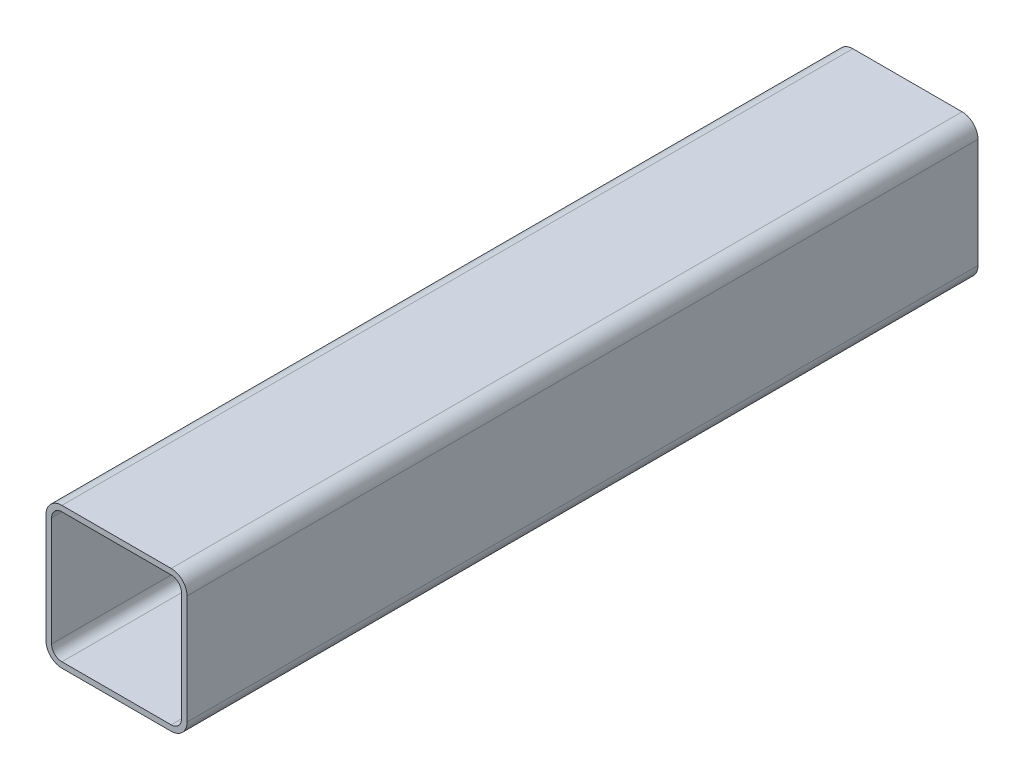
ISO-10303-21;
HEADER;
FILE_DESCRIPTION(('STEP AP214'),'2;1');
FILE_NAME('part.step','',(''),(''),'','','');
FILE_SCHEMA(('AUTOMOTIVE_DESIGN { 1 0 10303 214 1 1 1 1 }'));
ENDSEC;
DATA;
#1=APPLICATION_CONTEXT('core data for automotive mechanical design processes');
#2=APPLICATION_PROTOCOL_DEFINITION('international standard','automotive_design',2000,#1);
#3=PRODUCT_CONTEXT('',#1,'mechanical');
#4=PRODUCT('Part','Part','',(#3));
#5=PRODUCT_RELATED_PRODUCT_CATEGORY('part','',(#4));
#6=PRODUCT_DEFINITION_FORMATION('','',#4);
#7=PRODUCT_DEFINITION_CONTEXT('part definition',#1,'design');
#8=PRODUCT_DEFINITION('design','',#6,#7);
#9=PRODUCT_DEFINITION_SHAPE('','',#8);
#10=(LENGTH_UNIT() NAMED_UNIT(*) SI_UNIT(.MILLI.,.METRE.));
#11=(NAMED_UNIT(*) PLANE_ANGLE_UNIT() SI_UNIT($,.RADIAN.));
#12=(NAMED_UNIT(*) SI_UNIT($,.STERADIAN.) SOLID_ANGLE_UNIT());
#13=UNCERTAINTY_MEASURE_WITH_UNIT(LENGTH_MEASURE(1.E-05),#10,'distance_accuracy_value','');
#14=(GEOMETRIC_REPRESENTATION_CONTEXT(3) GLOBAL_UNCERTAINTY_ASSIGNED_CONTEXT((#13)) GLOBAL_UNIT_ASSIGNED_CONTEXT((#10,
#11,#12)) REPRESENTATION_CONTEXT('',''));
#15=CARTESIAN_POINT('',(0.,0.,0.));
#16=DIRECTION('',(0.,0.,1.));
#17=DIRECTION('',(1.,0.,0.));
#18=AXIS2_PLACEMENT_3D('',#15,#16,#17);
#19=CARTESIAN_POINT('',(-27.178,-27.178,-152.4));
#20=DIRECTION('',(0.,0.,1.));
#21=DIRECTION('',(1.,0.,0.));
#22=AXIS2_PLACEMENT_3D('',#19,#20,#21);
#23=PLANE('',#22);
#24=DIRECTION('',(0.,1.,0.));
#25=VECTOR('',#24,1.);
#26=CARTESIAN_POINT('',(-25.019,0.,-152.4));
#27=LINE('',#26,#25);
#28=CARTESIAN_POINT('',(-25.019,-21.0502500003569,-152.4));
#29=VERTEX_POINT('',#28);
#30=CARTESIAN_POINT('',(-25.019,21.0502499999995,-152.4));
#31=VERTEX_POINT('',#30);
#32=EDGE_CURVE('E158',#29,#31,#27,.T.);
#33=ORIENTED_EDGE('',*,*,#32,.F.);
#34=CARTESIAN_POINT('',(-21.05025,-21.0502500000011,-152.4));
#35=DIRECTION('',(0.,0.,-1.));
#36=DIRECTION('',(0.,1.,0.));
#37=AXIS2_PLACEMENT_3D('',#34,#35,#36);
#38=CIRCLE('',#37,3.96875);
#39=CARTESIAN_POINT('',(-21.0502499992366,-25.019,-152.4));
#40=VERTEX_POINT('',#39);
#41=EDGE_CURVE('E209',#40,#29,#38,.T.);
#42=ORIENTED_EDGE('',*,*,#41,.F.);
#43=DIRECTION('',(-1.,0.,0.));
#44=VECTOR('',#43,1.);
#45=CARTESIAN_POINT('',(0.,-25.019,-152.4));
#46=LINE('',#45,#44);
#47=CARTESIAN_POINT('',(21.05025,-25.019,-152.4));
#48=VERTEX_POINT('',#47);
#49=EDGE_CURVE('E154',#48,#40,#46,.T.);
#50=ORIENTED_EDGE('',*,*,#49,.F.);
#51=CARTESIAN_POINT('',(21.05025,-21.0502500000011,-152.4));
#52=DIRECTION('',(0.,0.,-1.));
#53=DIRECTION('',(0.,1.,0.));
#54=AXIS2_PLACEMENT_3D('',#51,#52,#53);
#55=CIRCLE('',#54,3.96875);
#56=CARTESIAN_POINT('',(25.019,-21.0502500008145,-152.4));
#57=VERTEX_POINT('',#56);
#58=EDGE_CURVE('E213',#57,#48,#55,.T.);
#59=ORIENTED_EDGE('',*,*,#58,.F.);
#60=DIRECTION('',(0.,-1.,0.));
#61=VECTOR('',#60,1.);
#62=CARTESIAN_POINT('',(25.019,0.,-152.4));
#63=LINE('',#62,#61);
#64=CARTESIAN_POINT('',(25.019,21.0502499999995,-152.4));
#65=VERTEX_POINT('',#64);
#66=EDGE_CURVE('E163',#65,#57,#63,.T.);
#67=ORIENTED_EDGE('',*,*,#66,.F.);
#68=CARTESIAN_POINT('',(21.05025,21.0502499999989,-152.4));
#69=DIRECTION('',(0.,0.,-1.));
#70=DIRECTION('',(0.,1.,0.));
#71=AXIS2_PLACEMENT_3D('',#68,#69,#70);
#72=CIRCLE('',#71,3.96875);
#73=CARTESIAN_POINT('',(21.050250000407,25.019,-152.4));
#74=VERTEX_POINT('',#73);
#75=EDGE_CURVE('E216',#74,#65,#72,.T.);
#76=ORIENTED_EDGE('',*,*,#75,.F.);
#77=DIRECTION('',(1.,0.,0.));
#78=VECTOR('',#77,1.);
#79=CARTESIAN_POINT('',(0.,25.019,-152.4));
#80=LINE('',#79,#78);
#81=CARTESIAN_POINT('',(-21.05025,25.019,-152.4));
#82=VERTEX_POINT('',#81);
#83=EDGE_CURVE('E168',#82,#74,#80,.T.);
#84=ORIENTED_EDGE('',*,*,#83,.F.);
#85=CARTESIAN_POINT('',(-21.05025,21.0502499999989,-152.4));
#86=DIRECTION('',(0.,0.,-1.));
#87=DIRECTION('',(0.,1.,0.));
#88=AXIS2_PLACEMENT_3D('',#85,#86,#87);
#89=CIRCLE('',#88,3.96875);
#90=EDGE_CURVE('E161',#31,#82,#89,.T.);
#91=ORIENTED_EDGE('',*,*,#90,.F.);
#92=EDGE_LOOP('',(#33,#42,#50,#59,#67,#76,#84,#91));
#93=FACE_BOUND('',#92,.T.);
#94=DIRECTION('',(0.,-1.,0.));
#95=VECTOR('',#94,1.);
#96=CARTESIAN_POINT('',(27.178,0.,-152.4));
#97=LINE('',#96,#95);
#98=CARTESIAN_POINT('',(27.178,21.0502499999997,-152.4));
#99=VERTEX_POINT('',#98);
#100=CARTESIAN_POINT('',(27.178,-21.0502500000003,-152.4));
#101=VERTEX_POINT('',#100);
#102=EDGE_CURVE('E162',#99,#101,#97,.T.);
#103=ORIENTED_EDGE('',*,*,#102,.T.);
#104=CARTESIAN_POINT('',(21.05025,-21.0502500000007,-152.4));
#105=DIRECTION('',(0.,0.,-1.));
#106=DIRECTION('',(0.,1.,0.));
#107=AXIS2_PLACEMENT_3D('',#104,#105,#106);
#108=CIRCLE('',#107,6.12775);
#109=CARTESIAN_POINT('',(21.0502500011786,-27.178,-152.4));
#110=VERTEX_POINT('',#109);
#111=EDGE_CURVE('E221',#101,#110,#108,.T.);
#112=ORIENTED_EDGE('',*,*,#111,.T.);
#113=DIRECTION('',(-1.,0.,0.));
#114=VECTOR('',#113,1.);
#115=CARTESIAN_POINT('',(0.,-27.178,-152.4));
#116=LINE('',#115,#114);
#117=CARTESIAN_POINT('',(-21.05025,-27.178,-152.4));
#118=VERTEX_POINT('',#117);
#119=EDGE_CURVE('E174',#110,#118,#116,.T.);
#120=ORIENTED_EDGE('',*,*,#119,.T.);
#121=CARTESIAN_POINT('',(-21.05025,-21.0502500000007,-152.4));
#122=DIRECTION('',(0.,0.,-1.));
#123=DIRECTION('',(0.,1.,0.));
#124=AXIS2_PLACEMENT_3D('',#121,#122,#123);
#125=CIRCLE('',#124,6.12775);
#126=CARTESIAN_POINT('',(-27.178,-21.0502500005506,-152.4));
#127=VERTEX_POINT('',#126);
#128=EDGE_CURVE('E225',#118,#127,#125,.T.);
#129=ORIENTED_EDGE('',*,*,#128,.T.);
#130=DIRECTION('',(0.,1.,0.));
#131=VECTOR('',#130,1.);
#132=CARTESIAN_POINT('',(-27.178,0.,-152.4));
#133=LINE('',#132,#131);
#134=CARTESIAN_POINT('',(-27.178,21.0502499999997,-152.4));
#135=VERTEX_POINT('',#134);
#136=EDGE_CURVE('E179',#127,#135,#133,.T.);
#137=ORIENTED_EDGE('',*,*,#136,.T.);
#138=CARTESIAN_POINT('',(-21.05025,21.0502499999993,-152.4));
#139=DIRECTION('',(0.,0.,-1.));
#140=DIRECTION('',(0.,1.,0.));
#141=AXIS2_PLACEMENT_3D('',#138,#139,#140);
#142=CIRCLE('',#141,6.12775);
#143=CARTESIAN_POINT('',(-21.0502499993716,27.178,-152.4));
#144=VERTEX_POINT('',#143);
#145=EDGE_CURVE('E141',#135,#144,#142,.T.);
#146=ORIENTED_EDGE('',*,*,#145,.T.);
#147=DIRECTION('',(1.,0.,0.));
#148=VECTOR('',#147,1.);
#149=CARTESIAN_POINT('',(0.,27.178,-152.4));
#150=LINE('',#149,#148);
#151=CARTESIAN_POINT('',(21.05025,27.178,-152.4));
#152=VERTEX_POINT('',#151);
#153=EDGE_CURVE('E139',#144,#152,#150,.T.);
#154=ORIENTED_EDGE('',*,*,#153,.T.);
#155=CARTESIAN_POINT('',(21.05025,21.0502499999993,-152.4));
#156=DIRECTION('',(0.,0.,-1.));
#157=DIRECTION('',(0.,1.,0.));
#158=AXIS2_PLACEMENT_3D('',#155,#156,#157);
#159=CIRCLE('',#158,6.12775);
#160=EDGE_CURVE('E20',#152,#99,#159,.T.);
#161=ORIENTED_EDGE('',*,*,#160,.T.);
#162=EDGE_LOOP('',(#103,#112,#120,#129,#137,#146,#154,#161));
#163=FACE_BOUND('',#162,.T.);
#164=ADVANCED_FACE('F16',(#93,#163),#23,.F.);
#165=CARTESIAN_POINT('',(21.05025,21.05025,152.4));
#166=DIRECTION('',(0.,0.,-1.));
#167=DIRECTION('',(0.,1.,0.));
#168=AXIS2_PLACEMENT_3D('',#165,#166,#167);
#169=CYLINDRICAL_SURFACE('',#168,6.12775);
#170=DIRECTION('',(0.,0.,1.));
#171=VECTOR('',#170,1.);
#172=CARTESIAN_POINT('',(21.05025,27.178,0.));
#173=LINE('',#172,#171);
#174=CARTESIAN_POINT('',(21.05025,27.178,152.4));
#175=VERTEX_POINT('',#174);
#176=EDGE_CURVE('E131',#152,#175,#173,.T.);
#177=ORIENTED_EDGE('',*,*,#176,.T.);
#178=CARTESIAN_POINT('',(21.05025,21.05025,152.4));
#179=DIRECTION('',(0.,0.,-1.));
#180=DIRECTION('',(0.,1.,0.));
#181=AXIS2_PLACEMENT_3D('',#178,#179,#180);
#182=CIRCLE('',#181,6.12775);
#183=CARTESIAN_POINT('',(27.178,21.05025,152.4));
#184=VERTEX_POINT('',#183);
#185=EDGE_CURVE('E207',#184,#175,#182,.F.);
#186=ORIENTED_EDGE('',*,*,#185,.F.);
#187=DIRECTION('',(0.,0.,-1.));
#188=VECTOR('',#187,1.);
#189=CARTESIAN_POINT('',(27.178,21.05025,0.));
#190=LINE('',#189,#188);
#191=EDGE_CURVE('E134',#184,#99,#190,.T.);
#192=ORIENTED_EDGE('',*,*,#191,.T.);
#193=ORIENTED_EDGE('',*,*,#160,.F.);
#194=EDGE_LOOP('',(#177,#186,#192,#193));
#195=FACE_BOUND('',#194,.T.);
#196=ADVANCED_FACE('F129',(#195),#169,.T.);
#197=CARTESIAN_POINT('',(-21.05025,27.178,152.4));
#198=DIRECTION('',(0.,-1.,0.));
#199=DIRECTION('',(0.,0.,-1.));
#200=AXIS2_PLACEMENT_3D('',#197,#198,#199);
#201=PLANE('',#200);
#202=DIRECTION('',(0.,0.,-1.));
#203=VECTOR('',#202,1.);
#204=CARTESIAN_POINT('',(-21.0502499987432,27.178,0.));
#205=LINE('',#204,#203);
#206=CARTESIAN_POINT('',(-21.0502499993716,27.178,152.4));
#207=VERTEX_POINT('',#206);
#208=EDGE_CURVE('E144',#144,#207,#205,.F.);
#209=ORIENTED_EDGE('',*,*,#208,.T.);
#210=DIRECTION('',(-1.,0.,0.));
#211=VECTOR('',#210,1.);
#212=CARTESIAN_POINT('',(0.,27.178,152.4));
#213=LINE('',#212,#211);
#214=EDGE_CURVE('E148',#175,#207,#213,.T.);
#215=ORIENTED_EDGE('',*,*,#214,.F.);
#216=ORIENTED_EDGE('',*,*,#176,.F.);
#217=ORIENTED_EDGE('',*,*,#153,.F.);
#218=EDGE_LOOP('',(#209,#215,#216,#217));
#219=FACE_BOUND('',#218,.T.);
#220=ADVANCED_FACE('F146',(#219),#201,.F.);
#221=CARTESIAN_POINT('',(-21.05025,21.05025,152.4));
#222=DIRECTION('',(0.,0.,-1.));
#223=DIRECTION('',(0.,1.,0.));
#224=AXIS2_PLACEMENT_3D('',#221,#222,#223);
#225=CYLINDRICAL_SURFACE('',#224,6.12775);
#226=DIRECTION('',(0.,0.,1.));
#227=VECTOR('',#226,1.);
#228=CARTESIAN_POINT('',(-27.178,21.05025,0.));
#229=LINE('',#228,#227);
#230=CARTESIAN_POINT('',(-27.178,21.05025,152.4));
#231=VERTEX_POINT('',#230);
#232=EDGE_CURVE('E181',#135,#231,#229,.T.);
#233=ORIENTED_EDGE('',*,*,#232,.T.);
#234=CARTESIAN_POINT('',(-21.05025,21.05025,152.4));
#235=DIRECTION('',(0.,0.,-1.));
#236=DIRECTION('',(0.,1.,0.));
#237=AXIS2_PLACEMENT_3D('',#234,#235,#236);
#238=CIRCLE('',#237,6.12775);
#239=EDGE_CURVE('E204',#207,#231,#238,.F.);
#240=ORIENTED_EDGE('',*,*,#239,.F.);
#241=ORIENTED_EDGE('',*,*,#208,.F.);
#242=ORIENTED_EDGE('',*,*,#145,.F.);
#243=EDGE_LOOP('',(#233,#240,#241,#242));
#244=FACE_BOUND('',#243,.T.);
#245=ADVANCED_FACE('F229',(#244),#225,.T.);
#246=CARTESIAN_POINT('',(-27.178,-21.05025,152.4));
#247=DIRECTION('',(1.,0.,0.));
#248=DIRECTION('',(0.,0.,-1.));
#249=AXIS2_PLACEMENT_3D('',#246,#247,#248);
#250=PLANE('',#249);
#251=DIRECTION('',(0.,0.,-1.));
#252=VECTOR('',#251,1.);
#253=CARTESIAN_POINT('',(-27.178,-21.0502500011005,0.));
#254=LINE('',#253,#252);
#255=CARTESIAN_POINT('',(-27.178,-21.0502500005502,152.4));
#256=VERTEX_POINT('',#255);
#257=EDGE_CURVE('E180',#127,#256,#254,.F.);
#258=ORIENTED_EDGE('',*,*,#257,.T.);
#259=DIRECTION('',(0.,-1.,0.));
#260=VECTOR('',#259,1.);
#261=CARTESIAN_POINT('',(-27.178,0.,152.4));
#262=LINE('',#261,#260);
#263=EDGE_CURVE('E203',#231,#256,#262,.T.);
#264=ORIENTED_EDGE('',*,*,#263,.F.);
#265=ORIENTED_EDGE('',*,*,#232,.F.);
#266=ORIENTED_EDGE('',*,*,#136,.F.);
#267=EDGE_LOOP('',(#258,#264,#265,#266));
#268=FACE_BOUND('',#267,.T.);
#269=ADVANCED_FACE('F261',(#268),#250,.F.);
#270=CARTESIAN_POINT('',(-21.05025,-21.05025,152.4));
#271=DIRECTION('',(0.,0.,-1.));
#272=DIRECTION('',(0.,1.,0.));
#273=AXIS2_PLACEMENT_3D('',#270,#271,#272);
#274=CYLINDRICAL_SURFACE('',#273,6.12775);
#275=DIRECTION('',(0.,0.,1.));
#276=VECTOR('',#275,1.);
#277=CARTESIAN_POINT('',(-21.05025,-27.178,0.));
#278=LINE('',#277,#276);
#279=CARTESIAN_POINT('',(-21.05025,-27.178,152.4));
#280=VERTEX_POINT('',#279);
#281=EDGE_CURVE('E178',#118,#280,#278,.T.);
#282=ORIENTED_EDGE('',*,*,#281,.T.);
#283=CARTESIAN_POINT('',(-21.05025,-21.05025,152.4));
#284=DIRECTION('',(0.,0.,-1.));
#285=DIRECTION('',(0.,1.,0.));
#286=AXIS2_PLACEMENT_3D('',#283,#284,#285);
#287=CIRCLE('',#286,6.12775);
#288=EDGE_CURVE('E200',#256,#280,#287,.F.);
#289=ORIENTED_EDGE('',*,*,#288,.F.);
#290=ORIENTED_EDGE('',*,*,#257,.F.);
#291=ORIENTED_EDGE('',*,*,#128,.F.);
#292=EDGE_LOOP('',(#282,#289,#290,#291));
#293=FACE_BOUND('',#292,.T.);
#294=ADVANCED_FACE('F263',(#293),#274,.T.);
#295=CARTESIAN_POINT('',(-21.05025,-27.178,-152.4));
#296=DIRECTION('',(0.,1.,0.));
#297=DIRECTION('',(0.,0.,1.));
#298=AXIS2_PLACEMENT_3D('',#295,#296,#297);
#299=PLANE('',#298);
#300=DIRECTION('',(0.,0.,-1.));
#301=VECTOR('',#300,1.);
#302=CARTESIAN_POINT('',(21.0502500023573,-27.178,0.));
#303=LINE('',#302,#301);
#304=CARTESIAN_POINT('',(21.0502500011786,-27.178,152.4));
#305=VERTEX_POINT('',#304);
#306=EDGE_CURVE('E177',#110,#305,#303,.F.);
#307=ORIENTED_EDGE('',*,*,#306,.T.);
#308=DIRECTION('',(1.,0.,0.));
#309=VECTOR('',#308,1.);
#310=CARTESIAN_POINT('',(0.,-27.178,152.4));
#311=LINE('',#310,#309);
#312=EDGE_CURVE('E199',#280,#305,#311,.T.);
#313=ORIENTED_EDGE('',*,*,#312,.F.);
#314=ORIENTED_EDGE('',*,*,#281,.F.);
#315=ORIENTED_EDGE('',*,*,#119,.F.);
#316=EDGE_LOOP('',(#307,#313,#314,#315));
#317=FACE_BOUND('',#316,.T.);
#318=ADVANCED_FACE('F319',(#317),#299,.F.);
#319=CARTESIAN_POINT('',(21.05025,-21.05025,152.4));
#320=DIRECTION('',(0.,0.,-1.));
#321=DIRECTION('',(0.,1.,0.));
#322=AXIS2_PLACEMENT_3D('',#319,#320,#321);
#323=CYLINDRICAL_SURFACE('',#322,6.12775);
#324=DIRECTION('',(0.,0.,1.));
#325=VECTOR('',#324,1.);
#326=CARTESIAN_POINT('',(27.178,-21.05025,0.));
#327=LINE('',#326,#325);
#328=CARTESIAN_POINT('',(27.178,-21.05025,152.4));
#329=VERTEX_POINT('',#328);
#330=EDGE_CURVE('E224',#101,#329,#327,.T.);
#331=ORIENTED_EDGE('',*,*,#330,.T.);
#332=CARTESIAN_POINT('',(21.05025,-21.05025,152.4));
#333=DIRECTION('',(0.,0.,-1.));
#334=DIRECTION('',(0.,1.,0.));
#335=AXIS2_PLACEMENT_3D('',#332,#333,#334);
#336=CIRCLE('',#335,6.12775);
#337=EDGE_CURVE('E195',#305,#329,#336,.F.);
#338=ORIENTED_EDGE('',*,*,#337,.F.);
#339=ORIENTED_EDGE('',*,*,#306,.F.);
#340=ORIENTED_EDGE('',*,*,#111,.F.);
#341=EDGE_LOOP('',(#331,#338,#339,#340));
#342=FACE_BOUND('',#341,.T.);
#343=ADVANCED_FACE('F315',(#342),#323,.T.);
#344=CARTESIAN_POINT('',(27.178,-21.05025,-152.4));
#345=DIRECTION('',(-1.,0.,0.));
#346=DIRECTION('',(0.,0.,1.));
#347=AXIS2_PLACEMENT_3D('',#344,#345,#346);
#348=PLANE('',#347);
#349=ORIENTED_EDGE('',*,*,#191,.F.);
#350=DIRECTION('',(0.,1.,0.));
#351=VECTOR('',#350,1.);
#352=CARTESIAN_POINT('',(27.178,0.,152.4));
#353=LINE('',#352,#351);
#354=EDGE_CURVE('E198',#329,#184,#353,.T.);
#355=ORIENTED_EDGE('',*,*,#354,.F.);
#356=ORIENTED_EDGE('',*,*,#330,.F.);
#357=ORIENTED_EDGE('',*,*,#102,.F.);
#358=EDGE_LOOP('',(#349,#355,#356,#357));
#359=FACE_BOUND('',#358,.T.);
#360=ADVANCED_FACE('F318',(#359),#348,.F.);
#361=CARTESIAN_POINT('',(-25.019,-21.05025,152.4));
#362=DIRECTION('',(1.,0.,0.));
#363=DIRECTION('',(0.,0.,-1.));
#364=AXIS2_PLACEMENT_3D('',#361,#362,#363);
#365=PLANE('',#364);
#366=DIRECTION('',(0.,1.,0.));
#367=VECTOR('',#366,1.);
#368=CARTESIAN_POINT('',(-25.019000009144,0.,152.4));
#369=LINE('',#368,#367);
#370=CARTESIAN_POINT('',(-25.019000004572,-21.0502500003564,152.4));
#371=VERTEX_POINT('',#370);
#372=CARTESIAN_POINT('',(-25.019000004572,21.05025,152.4));
#373=VERTEX_POINT('',#372);
#374=EDGE_CURVE('E194',#371,#373,#369,.T.);
#375=ORIENTED_EDGE('',*,*,#374,.F.);
#376=DIRECTION('',(0.,0.,-1.));
#377=VECTOR('',#376,1.);
#378=CARTESIAN_POINT('',(-25.019,-21.0502500007127,0.));
#379=LINE('',#378,#377);
#380=EDGE_CURVE('E212',#29,#371,#379,.F.);
#381=ORIENTED_EDGE('',*,*,#380,.F.);
#382=ORIENTED_EDGE('',*,*,#32,.T.);
#383=DIRECTION('',(0.,0.,1.));
#384=VECTOR('',#383,1.);
#385=CARTESIAN_POINT('',(-25.019,21.05025,0.));
#386=LINE('',#385,#384);
#387=EDGE_CURVE('E172',#373,#31,#386,.F.);
#388=ORIENTED_EDGE('',*,*,#387,.F.);
#389=EDGE_LOOP('',(#375,#381,#382,#388));
#390=FACE_BOUND('',#389,.T.);
#391=ADVANCED_FACE('F298',(#390),#365,.T.);
#392=CARTESIAN_POINT('',(-21.05025,21.05025,152.4));
#393=DIRECTION('',(0.,0.,-1.));
#394=DIRECTION('',(0.,1.,0.));
#395=AXIS2_PLACEMENT_3D('',#392,#393,#394);
#396=CYLINDRICAL_SURFACE('',#395,3.96875);
#397=CARTESIAN_POINT('',(-21.05025,21.05025,152.4));
#398=DIRECTION('',(0.,0.,-1.));
#399=DIRECTION('',(0.,1.,0.));
#400=AXIS2_PLACEMENT_3D('',#397,#398,#399);
#401=CIRCLE('',#400,3.96875);
#402=CARTESIAN_POINT('',(-21.05025,25.019000004572,152.4));
#403=VERTEX_POINT('',#402);
#404=EDGE_CURVE('E191',#373,#403,#401,.T.);
#405=ORIENTED_EDGE('',*,*,#404,.F.);
#406=ORIENTED_EDGE('',*,*,#387,.T.);
#407=ORIENTED_EDGE('',*,*,#90,.T.);
#408=DIRECTION('',(0.,0.,-1.));
#409=VECTOR('',#408,1.);
#410=CARTESIAN_POINT('',(-21.05025,25.019,0.));
#411=LINE('',#410,#409);
#412=EDGE_CURVE('E171',#403,#82,#411,.T.);
#413=ORIENTED_EDGE('',*,*,#412,.F.);
#414=EDGE_LOOP('',(#405,#406,#407,#413));
#415=FACE_BOUND('',#414,.T.);
#416=ADVANCED_FACE('F295',(#415),#396,.F.);
#417=CARTESIAN_POINT('',(-21.05025,25.019,152.4));
#418=DIRECTION('',(0.,-1.,0.));
#419=DIRECTION('',(0.,0.,-1.));
#420=AXIS2_PLACEMENT_3D('',#417,#418,#419);
#421=PLANE('',#420);
#422=DIRECTION('',(1.,0.,0.));
#423=VECTOR('',#422,1.);
#424=CARTESIAN_POINT('',(0.,25.019000009144,152.4));
#425=LINE('',#424,#423);
#426=CARTESIAN_POINT('',(21.050250000407,25.019000004572,152.4));
#427=VERTEX_POINT('',#426);
#428=EDGE_CURVE('E190',#403,#427,#425,.T.);
#429=ORIENTED_EDGE('',*,*,#428,.F.);
#430=ORIENTED_EDGE('',*,*,#412,.T.);
#431=ORIENTED_EDGE('',*,*,#83,.T.);
#432=DIRECTION('',(0.,0.,1.));
#433=VECTOR('',#432,1.);
#434=CARTESIAN_POINT('',(21.050250000814,25.019,0.));
#435=LINE('',#434,#433);
#436=EDGE_CURVE('E167',#427,#74,#435,.F.);
#437=ORIENTED_EDGE('',*,*,#436,.F.);
#438=EDGE_LOOP('',(#429,#430,#431,#437));
#439=FACE_BOUND('',#438,.T.);
#440=ADVANCED_FACE('F292',(#439),#421,.T.);
#441=CARTESIAN_POINT('',(21.05025,21.05025,152.4));
#442=DIRECTION('',(0.,0.,-1.));
#443=DIRECTION('',(0.,1.,0.));
#444=AXIS2_PLACEMENT_3D('',#441,#442,#443);
#445=CYLINDRICAL_SURFACE('',#444,3.96875);
#446=CARTESIAN_POINT('',(21.05025,21.05025,152.4));
#447=DIRECTION('',(0.,0.,-1.));
#448=DIRECTION('',(0.,1.,0.));
#449=AXIS2_PLACEMENT_3D('',#446,#447,#448);
#450=CIRCLE('',#449,3.96875);
#451=CARTESIAN_POINT('',(25.019000004572,21.05025,152.4));
#452=VERTEX_POINT('',#451);
#453=EDGE_CURVE('E187',#427,#452,#450,.T.);
#454=ORIENTED_EDGE('',*,*,#453,.F.);
#455=ORIENTED_EDGE('',*,*,#436,.T.);
#456=ORIENTED_EDGE('',*,*,#75,.T.);
#457=DIRECTION('',(0.,0.,-1.));
#458=VECTOR('',#457,1.);
#459=CARTESIAN_POINT('',(25.019,21.05025,0.));
#460=LINE('',#459,#458);
#461=EDGE_CURVE('E166',#452,#65,#460,.T.);
#462=ORIENTED_EDGE('',*,*,#461,.F.);
#463=EDGE_LOOP('',(#454,#455,#456,#462));
#464=FACE_BOUND('',#463,.T.);
#465=ADVANCED_FACE('F289',(#464),#445,.F.);
#466=CARTESIAN_POINT('',(25.019,-21.05025,-152.4));
#467=DIRECTION('',(-1.,0.,0.));
#468=DIRECTION('',(0.,0.,1.));
#469=AXIS2_PLACEMENT_3D('',#466,#467,#468);
#470=PLANE('',#469);
#471=DIRECTION('',(0.,-1.,0.));
#472=VECTOR('',#471,1.);
#473=CARTESIAN_POINT('',(25.019000009144,0.,152.4));
#474=LINE('',#473,#472);
#475=CARTESIAN_POINT('',(25.019000004572,-21.050250000814,152.4));
#476=VERTEX_POINT('',#475);
#477=EDGE_CURVE('E186',#452,#476,#474,.T.);
#478=ORIENTED_EDGE('',*,*,#477,.F.);
#479=ORIENTED_EDGE('',*,*,#461,.T.);
#480=ORIENTED_EDGE('',*,*,#66,.T.);
#481=DIRECTION('',(0.,0.,1.));
#482=VECTOR('',#481,1.);
#483=CARTESIAN_POINT('',(25.019,-21.050250001628,0.));
#484=LINE('',#483,#482);
#485=EDGE_CURVE('E157',#476,#57,#484,.F.);
#486=ORIENTED_EDGE('',*,*,#485,.F.);
#487=EDGE_LOOP('',(#478,#479,#480,#486));
#488=FACE_BOUND('',#487,.T.);
#489=ADVANCED_FACE('F286',(#488),#470,.T.);
#490=CARTESIAN_POINT('',(21.05025,-21.05025,152.4));
#491=DIRECTION('',(0.,0.,-1.));
#492=DIRECTION('',(0.,1.,0.));
#493=AXIS2_PLACEMENT_3D('',#490,#491,#492);
#494=CYLINDRICAL_SURFACE('',#493,3.96875);
#495=CARTESIAN_POINT('',(21.05025,-21.05025,152.4));
#496=DIRECTION('',(0.,0.,-1.));
#497=DIRECTION('',(0.,1.,0.));
#498=AXIS2_PLACEMENT_3D('',#495,#496,#497);
#499=CIRCLE('',#498,3.96875);
#500=CARTESIAN_POINT('',(21.05025,-25.019000004572,152.4));
#501=VERTEX_POINT('',#500);
#502=EDGE_CURVE('E183',#476,#501,#499,.T.);
#503=ORIENTED_EDGE('',*,*,#502,.F.);
#504=ORIENTED_EDGE('',*,*,#485,.T.);
#505=ORIENTED_EDGE('',*,*,#58,.T.);
#506=DIRECTION('',(0.,0.,-1.));
#507=VECTOR('',#506,1.);
#508=CARTESIAN_POINT('',(21.05025,-25.019,0.));
#509=LINE('',#508,#507);
#510=EDGE_CURVE('E156',#501,#48,#509,.T.);
#511=ORIENTED_EDGE('',*,*,#510,.F.);
#512=EDGE_LOOP('',(#503,#504,#505,#511));
#513=FACE_BOUND('',#512,.T.);
#514=ADVANCED_FACE('F282',(#513),#494,.F.);
#515=CARTESIAN_POINT('',(-21.05025,-25.019,-152.4));
#516=DIRECTION('',(0.,1.,0.));
#517=DIRECTION('',(0.,0.,1.));
#518=AXIS2_PLACEMENT_3D('',#515,#516,#517);
#519=PLANE('',#518);
#520=DIRECTION('',(-1.,0.,0.));
#521=VECTOR('',#520,1.);
#522=CARTESIAN_POINT('',(0.,-25.019000009144,152.4));
#523=LINE('',#522,#521);
#524=CARTESIAN_POINT('',(-21.0502499992366,-25.019000004572,152.4));
#525=VERTEX_POINT('',#524);
#526=EDGE_CURVE('E26',#501,#525,#523,.T.);
#527=ORIENTED_EDGE('',*,*,#526,.F.);
#528=ORIENTED_EDGE('',*,*,#510,.T.);
#529=ORIENTED_EDGE('',*,*,#49,.T.);
#530=DIRECTION('',(0.,0.,1.));
#531=VECTOR('',#530,1.);
#532=CARTESIAN_POINT('',(-21.0502499984733,-25.019,0.));
#533=LINE('',#532,#531);
#534=EDGE_CURVE('E35',#525,#40,#533,.F.);
#535=ORIENTED_EDGE('',*,*,#534,.F.);
#536=EDGE_LOOP('',(#527,#528,#529,#535));
#537=FACE_BOUND('',#536,.T.);
#538=ADVANCED_FACE('F280',(#537),#519,.T.);
#539=CARTESIAN_POINT('',(-21.05025,-21.05025,152.4));
#540=DIRECTION('',(0.,0.,-1.));
#541=DIRECTION('',(0.,1.,0.));
#542=AXIS2_PLACEMENT_3D('',#539,#540,#541);
#543=CYLINDRICAL_SURFACE('',#542,3.96875);
#544=CARTESIAN_POINT('',(-21.05025,-21.05025,152.4));
#545=DIRECTION('',(0.,0.,-1.));
#546=DIRECTION('',(0.,1.,0.));
#547=AXIS2_PLACEMENT_3D('',#544,#545,#546);
#548=CIRCLE('',#547,3.96875);
#549=EDGE_CURVE('E11',#525,#371,#548,.T.);
#550=ORIENTED_EDGE('',*,*,#549,.F.);
#551=ORIENTED_EDGE('',*,*,#534,.T.);
#552=ORIENTED_EDGE('',*,*,#41,.T.);
#553=ORIENTED_EDGE('',*,*,#380,.T.);
#554=EDGE_LOOP('',(#550,#551,#552,#553));
#555=FACE_BOUND('',#554,.T.);
#556=ADVANCED_FACE('F300',(#555),#543,.F.);
#557=CARTESIAN_POINT('',(-27.178,-27.178,152.4));
#558=DIRECTION('',(0.,0.,1.));
#559=DIRECTION('',(1.,0.,0.));
#560=AXIS2_PLACEMENT_3D('',#557,#558,#559);
#561=PLANE('',#560);
#562=ORIENTED_EDGE('',*,*,#526,.T.);
#563=ORIENTED_EDGE('',*,*,#549,.T.);
#564=ORIENTED_EDGE('',*,*,#374,.T.);
#565=ORIENTED_EDGE('',*,*,#404,.T.);
#566=ORIENTED_EDGE('',*,*,#428,.T.);
#567=ORIENTED_EDGE('',*,*,#453,.T.);
#568=ORIENTED_EDGE('',*,*,#477,.T.);
#569=ORIENTED_EDGE('',*,*,#502,.T.);
#570=EDGE_LOOP('',(#562,#563,#564,#565,#566,#567,#568,#569));
#571=FACE_BOUND('',#570,.T.);
#572=ORIENTED_EDGE('',*,*,#337,.T.);
#573=ORIENTED_EDGE('',*,*,#354,.T.);
#574=ORIENTED_EDGE('',*,*,#185,.T.);
#575=ORIENTED_EDGE('',*,*,#214,.T.);
#576=ORIENTED_EDGE('',*,*,#239,.T.);
#577=ORIENTED_EDGE('',*,*,#263,.T.);
#578=ORIENTED_EDGE('',*,*,#288,.T.);
#579=ORIENTED_EDGE('',*,*,#312,.T.);
#580=EDGE_LOOP('',(#572,#573,#574,#575,#576,#577,#578,#579));
#581=FACE_BOUND('',#580,.T.);
#582=ADVANCED_FACE('F18',(#571,#581),#561,.T.);
#583=CLOSED_SHELL('',(#164,#196,#220,#245,#269,#294,#318,#343,#360,#391,#416,#440,#465,#489,
#514,#538,#556,#582));
#584=MANIFOLD_SOLID_BREP('B1',#583);
#585=ADVANCED_BREP_SHAPE_REPRESENTATION('',(#18,#584),#14);
#586=SHAPE_DEFINITION_REPRESENTATION(#9,#585);
ENDSEC;
END-ISO-10303-21;
